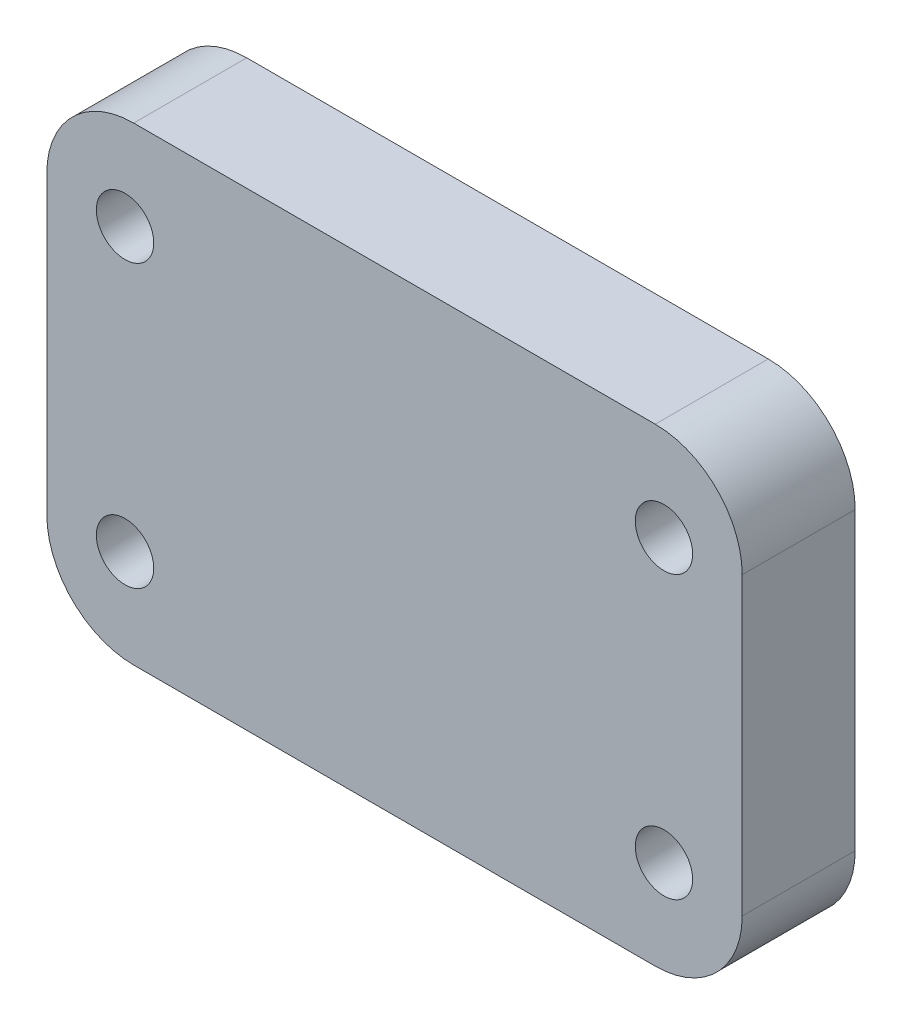
ISO-10303-21;
HEADER;
FILE_DESCRIPTION(('STEP AP214'),'2;1');
FILE_NAME('part.step','',(''),(''),'','','');
FILE_SCHEMA(('AUTOMOTIVE_DESIGN { 1 0 10303 214 1 1 1 1 }'));
ENDSEC;
DATA;
#1=APPLICATION_CONTEXT('core data for automotive mechanical design processes');
#2=APPLICATION_PROTOCOL_DEFINITION('international standard','automotive_design',2000,#1);
#3=PRODUCT_CONTEXT('',#1,'mechanical');
#4=PRODUCT('Part','Part','',(#3));
#5=PRODUCT_RELATED_PRODUCT_CATEGORY('part','',(#4));
#6=PRODUCT_DEFINITION_FORMATION('','',#4);
#7=PRODUCT_DEFINITION_CONTEXT('part definition',#1,'design');
#8=PRODUCT_DEFINITION('design','',#6,#7);
#9=PRODUCT_DEFINITION_SHAPE('','',#8);
#10=(LENGTH_UNIT() NAMED_UNIT(*) SI_UNIT(.MILLI.,.METRE.));
#11=(NAMED_UNIT(*) PLANE_ANGLE_UNIT() SI_UNIT($,.RADIAN.));
#12=(NAMED_UNIT(*) SI_UNIT($,.STERADIAN.) SOLID_ANGLE_UNIT());
#13=UNCERTAINTY_MEASURE_WITH_UNIT(LENGTH_MEASURE(1.E-05),#10,'distance_accuracy_value','');
#14=(GEOMETRIC_REPRESENTATION_CONTEXT(3) GLOBAL_UNCERTAINTY_ASSIGNED_CONTEXT((#13)) GLOBAL_UNIT_ASSIGNED_CONTEXT((#10,
#11,#12)) REPRESENTATION_CONTEXT('',''));
#15=CARTESIAN_POINT('',(0.,0.,0.));
#16=DIRECTION('',(0.,0.,1.));
#17=DIRECTION('',(1.,0.,0.));
#18=AXIS2_PLACEMENT_3D('',#15,#16,#17);
#19=CARTESIAN_POINT('',(0.,29.,39.));
#20=DIRECTION('',(0.,0.,1.));
#21=DIRECTION('',(1.,0.,0.));
#22=AXIS2_PLACEMENT_3D('',#19,#20,#21);
#23=PLANE('',#22);
#24=CARTESIAN_POINT('',(-31.,12.8,39.));
#25=DIRECTION('',(0.,0.,-1.));
#26=DIRECTION('',(-1.,0.,0.));
#27=AXIS2_PLACEMENT_3D('',#24,#25,#26);
#28=CIRCLE('',#27,3.3);
#29=CARTESIAN_POINT('',(-34.3,12.8,39.));
#30=VERTEX_POINT('',#29);
#31=EDGE_CURVE('E136',#30,#30,#28,.T.);
#32=ORIENTED_EDGE('',*,*,#31,.T.);
#33=EDGE_LOOP('',(#32));
#34=FACE_BOUND('',#33,.T.);
#35=CARTESIAN_POINT('',(31.,12.8,39.));
#36=DIRECTION('',(0.,0.,-1.));
#37=DIRECTION('',(-1.,0.,0.));
#38=AXIS2_PLACEMENT_3D('',#35,#36,#37);
#39=CIRCLE('',#38,3.3);
#40=CARTESIAN_POINT('',(27.7,12.8,39.));
#41=VERTEX_POINT('',#40);
#42=EDGE_CURVE('E139',#41,#41,#39,.T.);
#43=ORIENTED_EDGE('',*,*,#42,.T.);
#44=EDGE_LOOP('',(#43));
#45=FACE_BOUND('',#44,.T.);
#46=CARTESIAN_POINT('',(31.,45.2,39.));
#47=DIRECTION('',(0.,0.,-1.));
#48=DIRECTION('',(-1.,0.,0.));
#49=AXIS2_PLACEMENT_3D('',#46,#47,#48);
#50=CIRCLE('',#49,3.3);
#51=CARTESIAN_POINT('',(27.7,45.2,39.));
#52=VERTEX_POINT('',#51);
#53=EDGE_CURVE('E142',#52,#52,#50,.T.);
#54=ORIENTED_EDGE('',*,*,#53,.T.);
#55=EDGE_LOOP('',(#54));
#56=FACE_BOUND('',#55,.T.);
#57=CARTESIAN_POINT('',(-31.,45.2,39.));
#58=DIRECTION('',(0.,0.,-1.));
#59=DIRECTION('',(-1.,0.,0.));
#60=AXIS2_PLACEMENT_3D('',#57,#58,#59);
#61=CIRCLE('',#60,3.3);
#62=CARTESIAN_POINT('',(-34.3,45.2,39.));
#63=VERTEX_POINT('',#62);
#64=EDGE_CURVE('E145',#63,#63,#61,.T.);
#65=ORIENTED_EDGE('',*,*,#64,.T.);
#66=EDGE_LOOP('',(#65));
#67=FACE_BOUND('',#66,.T.);
#68=DIRECTION('',(0.,1.,0.));
#69=VECTOR('',#68,1.);
#70=CARTESIAN_POINT('',(40.,12.,39.));
#71=LINE('',#70,#69);
#72=CARTESIAN_POINT('',(40.,46.,39.));
#73=VERTEX_POINT('',#72);
#74=CARTESIAN_POINT('',(40.,12.,39.));
#75=VERTEX_POINT('',#74);
#76=EDGE_CURVE('E107',#73,#75,#71,.F.);
#77=ORIENTED_EDGE('',*,*,#76,.F.);
#78=CARTESIAN_POINT('',(30.,46.,39.));
#79=DIRECTION('',(0.,0.,1.));
#80=DIRECTION('',(1.,0.,0.));
#81=AXIS2_PLACEMENT_3D('',#78,#79,#80);
#82=CIRCLE('',#81,10.);
#83=CARTESIAN_POINT('',(30.,56.,39.));
#84=VERTEX_POINT('',#83);
#85=EDGE_CURVE('E148',#84,#73,#82,.F.);
#86=ORIENTED_EDGE('',*,*,#85,.F.);
#87=DIRECTION('',(-1.,0.,0.));
#88=VECTOR('',#87,1.);
#89=CARTESIAN_POINT('',(30.,56.,39.));
#90=LINE('',#89,#88);
#91=CARTESIAN_POINT('',(-30.,56.,39.));
#92=VERTEX_POINT('',#91);
#93=EDGE_CURVE('E93',#92,#84,#90,.F.);
#94=ORIENTED_EDGE('',*,*,#93,.F.);
#95=CARTESIAN_POINT('',(-30.,46.,39.));
#96=DIRECTION('',(0.,0.,1.));
#97=DIRECTION('',(1.,0.,0.));
#98=AXIS2_PLACEMENT_3D('',#95,#96,#97);
#99=CIRCLE('',#98,10.);
#100=CARTESIAN_POINT('',(-40.,46.,39.));
#101=VERTEX_POINT('',#100);
#102=EDGE_CURVE('E19',#101,#92,#99,.F.);
#103=ORIENTED_EDGE('',*,*,#102,.F.);
#104=DIRECTION('',(0.,-1.,0.));
#105=VECTOR('',#104,1.);
#106=CARTESIAN_POINT('',(-40.,46.,39.));
#107=LINE('',#106,#105);
#108=CARTESIAN_POINT('',(-40.,12.,39.));
#109=VERTEX_POINT('',#108);
#110=EDGE_CURVE('E78',#109,#101,#107,.F.);
#111=ORIENTED_EDGE('',*,*,#110,.F.);
#112=CARTESIAN_POINT('',(-30.,12.,39.));
#113=DIRECTION('',(0.,0.,1.));
#114=DIRECTION('',(1.,0.,0.));
#115=AXIS2_PLACEMENT_3D('',#112,#113,#114);
#116=CIRCLE('',#115,10.);
#117=CARTESIAN_POINT('',(-30.,2.00000000000001,39.));
#118=VERTEX_POINT('',#117);
#119=EDGE_CURVE('E100',#118,#109,#116,.F.);
#120=ORIENTED_EDGE('',*,*,#119,.F.);
#121=DIRECTION('',(1.,0.,0.));
#122=VECTOR('',#121,1.);
#123=CARTESIAN_POINT('',(-30.,2.00000000000001,39.));
#124=LINE('',#123,#122);
#125=CARTESIAN_POINT('',(30.,2.00000000000001,39.));
#126=VERTEX_POINT('',#125);
#127=EDGE_CURVE('E111',#126,#118,#124,.F.);
#128=ORIENTED_EDGE('',*,*,#127,.F.);
#129=CARTESIAN_POINT('',(30.,12.,39.));
#130=DIRECTION('',(0.,0.,1.));
#131=DIRECTION('',(1.,0.,0.));
#132=AXIS2_PLACEMENT_3D('',#129,#130,#131);
#133=CIRCLE('',#132,10.);
#134=EDGE_CURVE('E151',#75,#126,#133,.F.);
#135=ORIENTED_EDGE('',*,*,#134,.F.);
#136=EDGE_LOOP('',(#77,#86,#94,#103,#111,#120,#128,#135));
#137=FACE_BOUND('',#136,.T.);
#138=ADVANCED_FACE('F16',(#34,#45,#56,#67,#137),#23,.T.);
#139=CARTESIAN_POINT('',(-30.,46.,26.));
#140=DIRECTION('',(0.,0.,1.));
#141=DIRECTION('',(1.,0.,0.));
#142=AXIS2_PLACEMENT_3D('',#139,#140,#141);
#143=CYLINDRICAL_SURFACE('',#142,10.);
#144=ORIENTED_EDGE('',*,*,#102,.T.);
#145=DIRECTION('',(0.,0.,1.));
#146=VECTOR('',#145,1.);
#147=CARTESIAN_POINT('',(-30.,56.,26.));
#148=LINE('',#147,#146);
#149=CARTESIAN_POINT('',(-30.,56.,26.));
#150=VERTEX_POINT('',#149);
#151=EDGE_CURVE('E106',#150,#92,#148,.T.);
#152=ORIENTED_EDGE('',*,*,#151,.F.);
#153=CARTESIAN_POINT('',(-30.,46.,26.));
#154=DIRECTION('',(0.,0.,1.));
#155=DIRECTION('',(1.,0.,0.));
#156=AXIS2_PLACEMENT_3D('',#153,#154,#155);
#157=CIRCLE('',#156,10.);
#158=CARTESIAN_POINT('',(-40.,46.,26.));
#159=VERTEX_POINT('',#158);
#160=EDGE_CURVE('E99',#150,#159,#157,.T.);
#161=ORIENTED_EDGE('',*,*,#160,.T.);
#162=DIRECTION('',(0.,0.,1.));
#163=VECTOR('',#162,1.);
#164=CARTESIAN_POINT('',(-40.,46.,26.));
#165=LINE('',#164,#163);
#166=EDGE_CURVE('E83',#101,#159,#165,.F.);
#167=ORIENTED_EDGE('',*,*,#166,.F.);
#168=EDGE_LOOP('',(#144,#152,#161,#167));
#169=FACE_BOUND('',#168,.T.);
#170=ADVANCED_FACE('F98',(#169),#143,.T.);
#171=CARTESIAN_POINT('',(-40.,46.,26.));
#172=DIRECTION('',(-1.,0.,0.));
#173=DIRECTION('',(0.,-1.,0.));
#174=AXIS2_PLACEMENT_3D('',#171,#172,#173);
#175=PLANE('',#174);
#176=ORIENTED_EDGE('',*,*,#110,.T.);
#177=ORIENTED_EDGE('',*,*,#166,.T.);
#178=DIRECTION('',(0.,1.,0.));
#179=VECTOR('',#178,1.);
#180=CARTESIAN_POINT('',(-40.,29.,26.));
#181=LINE('',#180,#179);
#182=CARTESIAN_POINT('',(-40.,12.,26.));
#183=VERTEX_POINT('',#182);
#184=EDGE_CURVE('E134',#159,#183,#181,.F.);
#185=ORIENTED_EDGE('',*,*,#184,.T.);
#186=DIRECTION('',(0.,0.,1.));
#187=VECTOR('',#186,1.);
#188=CARTESIAN_POINT('',(-40.,12.,26.));
#189=LINE('',#188,#187);
#190=EDGE_CURVE('E85',#109,#183,#189,.F.);
#191=ORIENTED_EDGE('',*,*,#190,.F.);
#192=EDGE_LOOP('',(#176,#177,#185,#191));
#193=FACE_BOUND('',#192,.T.);
#194=ADVANCED_FACE('F80',(#193),#175,.T.);
#195=CARTESIAN_POINT('',(-30.,12.,26.));
#196=DIRECTION('',(0.,0.,1.));
#197=DIRECTION('',(1.,0.,0.));
#198=AXIS2_PLACEMENT_3D('',#195,#196,#197);
#199=CYLINDRICAL_SURFACE('',#198,10.);
#200=ORIENTED_EDGE('',*,*,#119,.T.);
#201=ORIENTED_EDGE('',*,*,#190,.T.);
#202=CARTESIAN_POINT('',(-30.,12.,26.));
#203=DIRECTION('',(0.,0.,1.));
#204=DIRECTION('',(1.,0.,0.));
#205=AXIS2_PLACEMENT_3D('',#202,#203,#204);
#206=CIRCLE('',#205,10.);
#207=CARTESIAN_POINT('',(-30.,2.00000000000001,26.));
#208=VERTEX_POINT('',#207);
#209=EDGE_CURVE('E131',#183,#208,#206,.T.);
#210=ORIENTED_EDGE('',*,*,#209,.T.);
#211=DIRECTION('',(0.,0.,1.));
#212=VECTOR('',#211,1.);
#213=CARTESIAN_POINT('',(-30.,2.00000000000001,26.));
#214=LINE('',#213,#212);
#215=EDGE_CURVE('E112',#118,#208,#214,.F.);
#216=ORIENTED_EDGE('',*,*,#215,.F.);
#217=EDGE_LOOP('',(#200,#201,#210,#216));
#218=FACE_BOUND('',#217,.T.);
#219=ADVANCED_FACE('F186',(#218),#199,.T.);
#220=CARTESIAN_POINT('',(-30.,2.00000000000001,26.));
#221=DIRECTION('',(0.,-1.,0.));
#222=DIRECTION('',(1.,0.,0.));
#223=AXIS2_PLACEMENT_3D('',#220,#221,#222);
#224=PLANE('',#223);
#225=ORIENTED_EDGE('',*,*,#127,.T.);
#226=ORIENTED_EDGE('',*,*,#215,.T.);
#227=DIRECTION('',(1.,0.,0.));
#228=VECTOR('',#227,1.);
#229=CARTESIAN_POINT('',(0.,2.00000000000001,26.));
#230=LINE('',#229,#228);
#231=CARTESIAN_POINT('',(30.,2.00000000000001,26.));
#232=VERTEX_POINT('',#231);
#233=EDGE_CURVE('E130',#208,#232,#230,.T.);
#234=ORIENTED_EDGE('',*,*,#233,.T.);
#235=DIRECTION('',(0.,0.,1.));
#236=VECTOR('',#235,1.);
#237=CARTESIAN_POINT('',(30.,2.,26.));
#238=LINE('',#237,#236);
#239=EDGE_CURVE('E110',#126,#232,#238,.F.);
#240=ORIENTED_EDGE('',*,*,#239,.F.);
#241=EDGE_LOOP('',(#225,#226,#234,#240));
#242=FACE_BOUND('',#241,.T.);
#243=ADVANCED_FACE('F183',(#242),#224,.T.);
#244=CARTESIAN_POINT('',(30.,12.,26.));
#245=DIRECTION('',(0.,0.,1.));
#246=DIRECTION('',(1.,0.,0.));
#247=AXIS2_PLACEMENT_3D('',#244,#245,#246);
#248=CYLINDRICAL_SURFACE('',#247,10.);
#249=ORIENTED_EDGE('',*,*,#134,.T.);
#250=ORIENTED_EDGE('',*,*,#239,.T.);
#251=CARTESIAN_POINT('',(30.,12.,26.));
#252=DIRECTION('',(0.,0.,1.));
#253=DIRECTION('',(1.,0.,0.));
#254=AXIS2_PLACEMENT_3D('',#251,#252,#253);
#255=CIRCLE('',#254,10.);
#256=CARTESIAN_POINT('',(40.,12.,26.));
#257=VERTEX_POINT('',#256);
#258=EDGE_CURVE('E127',#232,#257,#255,.T.);
#259=ORIENTED_EDGE('',*,*,#258,.T.);
#260=DIRECTION('',(0.,0.,-1.));
#261=VECTOR('',#260,1.);
#262=CARTESIAN_POINT('',(40.,12.,26.));
#263=LINE('',#262,#261);
#264=EDGE_CURVE('E109',#75,#257,#263,.T.);
#265=ORIENTED_EDGE('',*,*,#264,.F.);
#266=EDGE_LOOP('',(#249,#250,#259,#265));
#267=FACE_BOUND('',#266,.T.);
#268=ADVANCED_FACE('F181',(#267),#248,.T.);
#269=CARTESIAN_POINT('',(40.,12.,26.));
#270=DIRECTION('',(1.,0.,0.));
#271=DIRECTION('',(0.,0.,-1.));
#272=AXIS2_PLACEMENT_3D('',#269,#270,#271);
#273=PLANE('',#272);
#274=ORIENTED_EDGE('',*,*,#76,.T.);
#275=ORIENTED_EDGE('',*,*,#264,.T.);
#276=DIRECTION('',(0.,1.,0.));
#277=VECTOR('',#276,1.);
#278=CARTESIAN_POINT('',(40.,29.,26.));
#279=LINE('',#278,#277);
#280=CARTESIAN_POINT('',(40.,46.,26.));
#281=VERTEX_POINT('',#280);
#282=EDGE_CURVE('E126',#257,#281,#279,.T.);
#283=ORIENTED_EDGE('',*,*,#282,.T.);
#284=DIRECTION('',(0.,0.,1.));
#285=VECTOR('',#284,1.);
#286=CARTESIAN_POINT('',(40.,46.,26.));
#287=LINE('',#286,#285);
#288=EDGE_CURVE('E150',#73,#281,#287,.F.);
#289=ORIENTED_EDGE('',*,*,#288,.F.);
#290=EDGE_LOOP('',(#274,#275,#283,#289));
#291=FACE_BOUND('',#290,.T.);
#292=ADVANCED_FACE('F179',(#291),#273,.T.);
#293=CARTESIAN_POINT('',(30.,46.,26.));
#294=DIRECTION('',(0.,0.,1.));
#295=DIRECTION('',(1.,0.,0.));
#296=AXIS2_PLACEMENT_3D('',#293,#294,#295);
#297=CYLINDRICAL_SURFACE('',#296,10.);
#298=ORIENTED_EDGE('',*,*,#85,.T.);
#299=ORIENTED_EDGE('',*,*,#288,.T.);
#300=CARTESIAN_POINT('',(30.,46.,26.));
#301=DIRECTION('',(0.,0.,1.));
#302=DIRECTION('',(1.,0.,0.));
#303=AXIS2_PLACEMENT_3D('',#300,#301,#302);
#304=CIRCLE('',#303,10.);
#305=CARTESIAN_POINT('',(30.,56.,26.));
#306=VERTEX_POINT('',#305);
#307=EDGE_CURVE('E123',#281,#306,#304,.T.);
#308=ORIENTED_EDGE('',*,*,#307,.T.);
#309=DIRECTION('',(0.,0.,1.));
#310=VECTOR('',#309,1.);
#311=CARTESIAN_POINT('',(30.,56.,26.));
#312=LINE('',#311,#310);
#313=EDGE_CURVE('E34',#84,#306,#312,.F.);
#314=ORIENTED_EDGE('',*,*,#313,.F.);
#315=EDGE_LOOP('',(#298,#299,#308,#314));
#316=FACE_BOUND('',#315,.T.);
#317=ADVANCED_FACE('F176',(#316),#297,.T.);
#318=CARTESIAN_POINT('',(30.,56.,26.));
#319=DIRECTION('',(0.,1.,0.));
#320=DIRECTION('',(-1.,0.,0.));
#321=AXIS2_PLACEMENT_3D('',#318,#319,#320);
#322=PLANE('',#321);
#323=ORIENTED_EDGE('',*,*,#93,.T.);
#324=ORIENTED_EDGE('',*,*,#313,.T.);
#325=DIRECTION('',(1.,0.,0.));
#326=VECTOR('',#325,1.);
#327=CARTESIAN_POINT('',(0.,56.,26.));
#328=LINE('',#327,#326);
#329=EDGE_CURVE('E122',#306,#150,#328,.F.);
#330=ORIENTED_EDGE('',*,*,#329,.T.);
#331=ORIENTED_EDGE('',*,*,#151,.T.);
#332=EDGE_LOOP('',(#323,#324,#330,#331));
#333=FACE_BOUND('',#332,.T.);
#334=ADVANCED_FACE('F170',(#333),#322,.T.);
#335=CARTESIAN_POINT('',(-31.,45.2,23.4));
#336=DIRECTION('',(0.,0.,-1.));
#337=DIRECTION('',(-1.,0.,0.));
#338=AXIS2_PLACEMENT_3D('',#335,#336,#337);
#339=CYLINDRICAL_SURFACE('',#338,3.3);
#340=CARTESIAN_POINT('',(-31.,45.2,26.));
#341=DIRECTION('',(0.,0.,-1.));
#342=DIRECTION('',(-1.,0.,0.));
#343=AXIS2_PLACEMENT_3D('',#340,#341,#342);
#344=CIRCLE('',#343,3.3);
#345=CARTESIAN_POINT('',(-34.3,45.2,26.));
#346=VERTEX_POINT('',#345);
#347=EDGE_CURVE('E119',#346,#346,#344,.T.);
#348=ORIENTED_EDGE('',*,*,#347,.T.);
#349=EDGE_LOOP('',(#348));
#350=FACE_BOUND('',#349,.T.);
#351=ORIENTED_EDGE('',*,*,#64,.F.);
#352=EDGE_LOOP('',(#351));
#353=FACE_BOUND('',#352,.T.);
#354=ADVANCED_FACE('F215',(#350,#353),#339,.F.);
#355=CARTESIAN_POINT('',(31.,45.2,23.4));
#356=DIRECTION('',(0.,0.,-1.));
#357=DIRECTION('',(-1.,0.,0.));
#358=AXIS2_PLACEMENT_3D('',#355,#356,#357);
#359=CYLINDRICAL_SURFACE('',#358,3.3);
#360=CARTESIAN_POINT('',(31.,45.2,26.));
#361=DIRECTION('',(0.,0.,-1.));
#362=DIRECTION('',(-1.,0.,0.));
#363=AXIS2_PLACEMENT_3D('',#360,#361,#362);
#364=CIRCLE('',#363,3.3);
#365=CARTESIAN_POINT('',(27.7,45.2,26.));
#366=VERTEX_POINT('',#365);
#367=EDGE_CURVE('E116',#366,#366,#364,.T.);
#368=ORIENTED_EDGE('',*,*,#367,.T.);
#369=EDGE_LOOP('',(#368));
#370=FACE_BOUND('',#369,.T.);
#371=ORIENTED_EDGE('',*,*,#53,.F.);
#372=EDGE_LOOP('',(#371));
#373=FACE_BOUND('',#372,.T.);
#374=ADVANCED_FACE('F211',(#370,#373),#359,.F.);
#375=CARTESIAN_POINT('',(31.,12.8,23.4));
#376=DIRECTION('',(0.,0.,-1.));
#377=DIRECTION('',(-1.,0.,0.));
#378=AXIS2_PLACEMENT_3D('',#375,#376,#377);
#379=CYLINDRICAL_SURFACE('',#378,3.3);
#380=CARTESIAN_POINT('',(31.,12.8,26.));
#381=DIRECTION('',(0.,0.,-1.));
#382=DIRECTION('',(-1.,0.,0.));
#383=AXIS2_PLACEMENT_3D('',#380,#381,#382);
#384=CIRCLE('',#383,3.3);
#385=CARTESIAN_POINT('',(27.7,12.8,26.));
#386=VERTEX_POINT('',#385);
#387=EDGE_CURVE('E25',#386,#386,#384,.T.);
#388=ORIENTED_EDGE('',*,*,#387,.T.);
#389=EDGE_LOOP('',(#388));
#390=FACE_BOUND('',#389,.T.);
#391=ORIENTED_EDGE('',*,*,#42,.F.);
#392=EDGE_LOOP('',(#391));
#393=FACE_BOUND('',#392,.T.);
#394=ADVANCED_FACE('F203',(#390,#393),#379,.F.);
#395=CARTESIAN_POINT('',(-31.,12.8,23.4));
#396=DIRECTION('',(0.,0.,-1.));
#397=DIRECTION('',(-1.,0.,0.));
#398=AXIS2_PLACEMENT_3D('',#395,#396,#397);
#399=CYLINDRICAL_SURFACE('',#398,3.3);
#400=CARTESIAN_POINT('',(-31.,12.8,26.));
#401=DIRECTION('',(0.,0.,-1.));
#402=DIRECTION('',(-1.,0.,0.));
#403=AXIS2_PLACEMENT_3D('',#400,#401,#402);
#404=CIRCLE('',#403,3.3);
#405=CARTESIAN_POINT('',(-34.3,12.8,26.));
#406=VERTEX_POINT('',#405);
#407=EDGE_CURVE('E11',#406,#406,#404,.T.);
#408=ORIENTED_EDGE('',*,*,#407,.T.);
#409=EDGE_LOOP('',(#408));
#410=FACE_BOUND('',#409,.T.);
#411=ORIENTED_EDGE('',*,*,#31,.F.);
#412=EDGE_LOOP('',(#411));
#413=FACE_BOUND('',#412,.T.);
#414=ADVANCED_FACE('F197',(#410,#413),#399,.F.);
#415=CARTESIAN_POINT('',(0.,29.,26.));
#416=DIRECTION('',(0.,0.,1.));
#417=DIRECTION('',(1.,0.,0.));
#418=AXIS2_PLACEMENT_3D('',#415,#416,#417);
#419=PLANE('',#418);
#420=ORIENTED_EDGE('',*,*,#407,.F.);
#421=EDGE_LOOP('',(#420));
#422=FACE_BOUND('',#421,.T.);
#423=ORIENTED_EDGE('',*,*,#387,.F.);
#424=EDGE_LOOP('',(#423));
#425=FACE_BOUND('',#424,.T.);
#426=ORIENTED_EDGE('',*,*,#367,.F.);
#427=EDGE_LOOP('',(#426));
#428=FACE_BOUND('',#427,.T.);
#429=ORIENTED_EDGE('',*,*,#347,.F.);
#430=EDGE_LOOP('',(#429));
#431=FACE_BOUND('',#430,.T.);
#432=ORIENTED_EDGE('',*,*,#307,.F.);
#433=ORIENTED_EDGE('',*,*,#282,.F.);
#434=ORIENTED_EDGE('',*,*,#258,.F.);
#435=ORIENTED_EDGE('',*,*,#233,.F.);
#436=ORIENTED_EDGE('',*,*,#209,.F.);
#437=ORIENTED_EDGE('',*,*,#184,.F.);
#438=ORIENTED_EDGE('',*,*,#160,.F.);
#439=ORIENTED_EDGE('',*,*,#329,.F.);
#440=EDGE_LOOP('',(#432,#433,#434,#435,#436,#437,#438,#439));
#441=FACE_BOUND('',#440,.T.);
#442=ADVANCED_FACE('F173',(#422,#425,#428,#431,#441),#419,.F.);
#443=CLOSED_SHELL('',(#138,#170,#194,#219,#243,#268,#292,#317,#334,#354,#374,#394,#414,#442));
#444=MANIFOLD_SOLID_BREP('B1',#443);
#445=ADVANCED_BREP_SHAPE_REPRESENTATION('',(#18,#444),#14);
#446=SHAPE_DEFINITION_REPRESENTATION(#9,#445);
ENDSEC;
END-ISO-10303-21;
